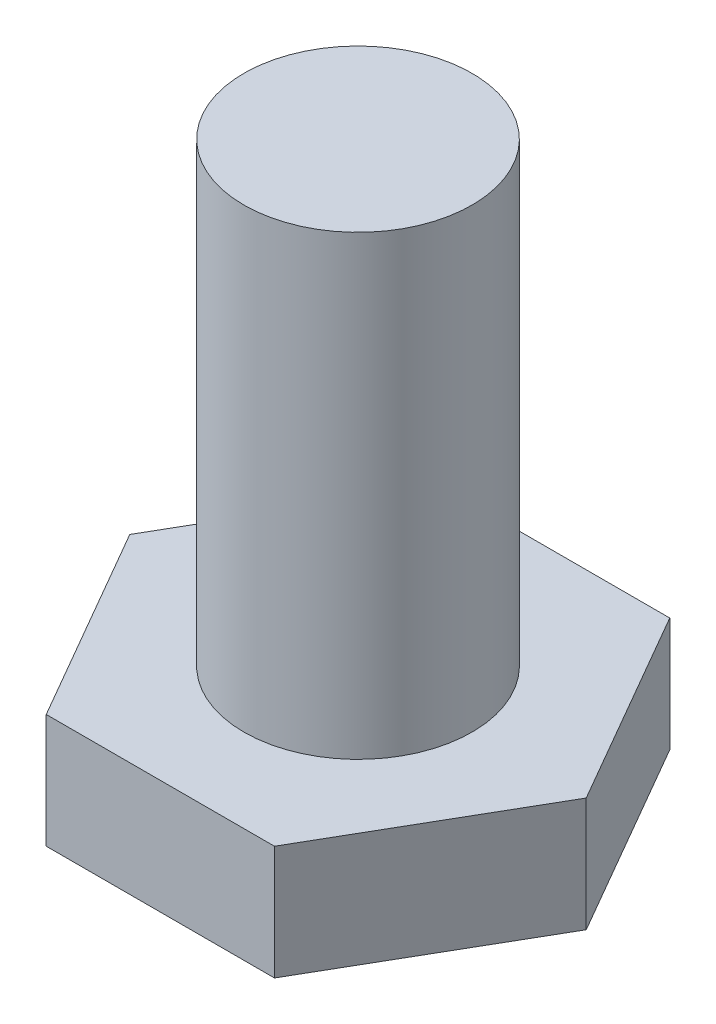
ISO-10303-21;
HEADER;
FILE_DESCRIPTION(('STEP AP214'),'2;1');
FILE_NAME('part.step','',(''),(''),'','','');
FILE_SCHEMA(('AUTOMOTIVE_DESIGN { 1 0 10303 214 1 1 1 1 }'));
ENDSEC;
DATA;
#1=APPLICATION_CONTEXT('core data for automotive mechanical design processes');
#2=APPLICATION_PROTOCOL_DEFINITION('international standard','automotive_design',2000,#1);
#3=PRODUCT_CONTEXT('',#1,'mechanical');
#4=PRODUCT('Part','Part','',(#3));
#5=PRODUCT_RELATED_PRODUCT_CATEGORY('part','',(#4));
#6=PRODUCT_DEFINITION_FORMATION('','',#4);
#7=PRODUCT_DEFINITION_CONTEXT('part definition',#1,'design');
#8=PRODUCT_DEFINITION('design','',#6,#7);
#9=PRODUCT_DEFINITION_SHAPE('','',#8);
#10=(LENGTH_UNIT() NAMED_UNIT(*) SI_UNIT(.MILLI.,.METRE.));
#11=(NAMED_UNIT(*) PLANE_ANGLE_UNIT() SI_UNIT($,.RADIAN.));
#12=(NAMED_UNIT(*) SI_UNIT($,.STERADIAN.) SOLID_ANGLE_UNIT());
#13=UNCERTAINTY_MEASURE_WITH_UNIT(LENGTH_MEASURE(1.E-05),#10,'distance_accuracy_value','');
#14=(GEOMETRIC_REPRESENTATION_CONTEXT(3) GLOBAL_UNCERTAINTY_ASSIGNED_CONTEXT((#13)) GLOBAL_UNIT_ASSIGNED_CONTEXT((#10,
#11,#12)) REPRESENTATION_CONTEXT('',''));
#15=CARTESIAN_POINT('',(0.,0.,0.));
#16=DIRECTION('',(0.,0.,1.));
#17=DIRECTION('',(1.,0.,0.));
#18=AXIS2_PLACEMENT_3D('',#15,#16,#17);
#19=CARTESIAN_POINT('',(-3.,3.,5.19615242270664));
#20=DIRECTION('',(0.,0.,-1.));
#21=DIRECTION('',(-1.,0.,0.));
#22=AXIS2_PLACEMENT_3D('',#19,#20,#21);
#23=PLANE('',#22);
#24=DIRECTION('',(1.,0.,0.));
#25=VECTOR('',#24,1.);
#26=CARTESIAN_POINT('',(-3.,0.,5.19615242270664));
#27=LINE('',#26,#25);
#28=CARTESIAN_POINT('',(-3.,0.,5.19615242270664));
#29=VERTEX_POINT('',#28);
#30=CARTESIAN_POINT('',(3.,0.,5.19615242270664));
#31=VERTEX_POINT('',#30);
#32=EDGE_CURVE('E133',#29,#31,#27,.T.);
#33=ORIENTED_EDGE('',*,*,#32,.T.);
#34=DIRECTION('',(0.,-1.,0.));
#35=VECTOR('',#34,1.);
#36=CARTESIAN_POINT('',(3.,3.,5.19615242270664));
#37=LINE('',#36,#35);
#38=CARTESIAN_POINT('',(3.,3.,5.19615242270664));
#39=VERTEX_POINT('',#38);
#40=EDGE_CURVE('E50',#39,#31,#37,.T.);
#41=ORIENTED_EDGE('',*,*,#40,.F.);
#42=DIRECTION('',(1.,0.,0.));
#43=VECTOR('',#42,1.);
#44=CARTESIAN_POINT('',(-3.,3.,5.19615242270664));
#45=LINE('',#44,#43);
#46=CARTESIAN_POINT('',(-3.,3.,5.19615242270664));
#47=VERTEX_POINT('',#46);
#48=EDGE_CURVE('E144',#47,#39,#45,.T.);
#49=ORIENTED_EDGE('',*,*,#48,.F.);
#50=DIRECTION('',(0.,-1.,0.));
#51=VECTOR('',#50,1.);
#52=CARTESIAN_POINT('',(-3.,3.,5.19615242270664));
#53=LINE('',#52,#51);
#54=EDGE_CURVE('E129',#47,#29,#53,.T.);
#55=ORIENTED_EDGE('',*,*,#54,.T.);
#56=EDGE_LOOP('',(#33,#41,#49,#55));
#57=FACE_BOUND('',#56,.T.);
#58=ADVANCED_FACE('F47',(#57),#23,.F.);
#59=CARTESIAN_POINT('',(3.,3.,5.19615242270664));
#60=DIRECTION('',(-0.866025403784439,0.,-0.499999999999999));
#61=DIRECTION('',(-0.499999999999999,0.,0.866025403784439));
#62=AXIS2_PLACEMENT_3D('',#59,#60,#61);
#63=PLANE('',#62);
#64=DIRECTION('',(0.499999999999999,0.,-0.866025403784439));
#65=VECTOR('',#64,1.);
#66=CARTESIAN_POINT('',(3.,0.,5.19615242270664));
#67=LINE('',#66,#65);
#68=CARTESIAN_POINT('',(6.,0.,0.));
#69=VERTEX_POINT('',#68);
#70=EDGE_CURVE('E136',#31,#69,#67,.T.);
#71=ORIENTED_EDGE('',*,*,#70,.T.);
#72=DIRECTION('',(0.,-1.,0.));
#73=VECTOR('',#72,1.);
#74=CARTESIAN_POINT('',(6.,3.,0.));
#75=LINE('',#74,#73);
#76=CARTESIAN_POINT('',(6.,3.,0.));
#77=VERTEX_POINT('',#76);
#78=EDGE_CURVE('E147',#77,#69,#75,.T.);
#79=ORIENTED_EDGE('',*,*,#78,.F.);
#80=DIRECTION('',(0.499999999999999,0.,-0.866025403784439));
#81=VECTOR('',#80,1.);
#82=CARTESIAN_POINT('',(3.,3.,5.19615242270664));
#83=LINE('',#82,#81);
#84=EDGE_CURVE('E102',#39,#77,#83,.T.);
#85=ORIENTED_EDGE('',*,*,#84,.F.);
#86=ORIENTED_EDGE('',*,*,#40,.T.);
#87=EDGE_LOOP('',(#71,#79,#85,#86));
#88=FACE_BOUND('',#87,.T.);
#89=ADVANCED_FACE('F152',(#88),#63,.F.);
#90=CARTESIAN_POINT('',(6.,3.,0.));
#91=DIRECTION('',(-0.866025403784439,0.,0.5));
#92=DIRECTION('',(0.5,0.,0.866025403784439));
#93=AXIS2_PLACEMENT_3D('',#90,#91,#92);
#94=PLANE('',#93);
#95=DIRECTION('',(-0.5,0.,-0.866025403784439));
#96=VECTOR('',#95,1.);
#97=CARTESIAN_POINT('',(6.,0.,0.));
#98=LINE('',#97,#96);
#99=CARTESIAN_POINT('',(3.,0.,-5.19615242270663));
#100=VERTEX_POINT('',#99);
#101=EDGE_CURVE('E139',#69,#100,#98,.T.);
#102=ORIENTED_EDGE('',*,*,#101,.T.);
#103=DIRECTION('',(0.,-1.,0.));
#104=VECTOR('',#103,1.);
#105=CARTESIAN_POINT('',(3.,3.,-5.19615242270663));
#106=LINE('',#105,#104);
#107=CARTESIAN_POINT('',(3.,3.,-5.19615242270663));
#108=VERTEX_POINT('',#107);
#109=EDGE_CURVE('E124',#108,#100,#106,.T.);
#110=ORIENTED_EDGE('',*,*,#109,.F.);
#111=DIRECTION('',(-0.5,0.,-0.866025403784439));
#112=VECTOR('',#111,1.);
#113=CARTESIAN_POINT('',(6.,3.,0.));
#114=LINE('',#113,#112);
#115=EDGE_CURVE('E115',#77,#108,#114,.T.);
#116=ORIENTED_EDGE('',*,*,#115,.F.);
#117=ORIENTED_EDGE('',*,*,#78,.T.);
#118=EDGE_LOOP('',(#102,#110,#116,#117));
#119=FACE_BOUND('',#118,.T.);
#120=ADVANCED_FACE('F158',(#119),#94,.F.);
#121=CARTESIAN_POINT('',(3.,3.,-5.19615242270663));
#122=DIRECTION('',(0.,0.,1.));
#123=DIRECTION('',(1.,0.,0.));
#124=AXIS2_PLACEMENT_3D('',#121,#122,#123);
#125=PLANE('',#124);
#126=DIRECTION('',(-1.,0.,0.));
#127=VECTOR('',#126,1.);
#128=CARTESIAN_POINT('',(3.,0.,-5.19615242270663));
#129=LINE('',#128,#127);
#130=CARTESIAN_POINT('',(-3.,0.,-5.19615242270663));
#131=VERTEX_POINT('',#130);
#132=EDGE_CURVE('E123',#100,#131,#129,.T.);
#133=ORIENTED_EDGE('',*,*,#132,.T.);
#134=DIRECTION('',(0.,-1.,0.));
#135=VECTOR('',#134,1.);
#136=CARTESIAN_POINT('',(-3.,3.,-5.19615242270663));
#137=LINE('',#136,#135);
#138=CARTESIAN_POINT('',(-3.,3.,-5.19615242270663));
#139=VERTEX_POINT('',#138);
#140=EDGE_CURVE('E120',#139,#131,#137,.T.);
#141=ORIENTED_EDGE('',*,*,#140,.F.);
#142=DIRECTION('',(-1.,0.,0.));
#143=VECTOR('',#142,1.);
#144=CARTESIAN_POINT('',(3.,3.,-5.19615242270663));
#145=LINE('',#144,#143);
#146=EDGE_CURVE('E109',#108,#139,#145,.T.);
#147=ORIENTED_EDGE('',*,*,#146,.F.);
#148=ORIENTED_EDGE('',*,*,#109,.T.);
#149=EDGE_LOOP('',(#133,#141,#147,#148));
#150=FACE_BOUND('',#149,.T.);
#151=ADVANCED_FACE('F121',(#150),#125,.F.);
#152=CARTESIAN_POINT('',(-3.,3.,-5.19615242270663));
#153=DIRECTION('',(0.866025403784439,0.,0.5));
#154=DIRECTION('',(0.5,0.,-0.866025403784439));
#155=AXIS2_PLACEMENT_3D('',#152,#153,#154);
#156=PLANE('',#155);
#157=DIRECTION('',(-0.5,0.,0.866025403784439));
#158=VECTOR('',#157,1.);
#159=CARTESIAN_POINT('',(-3.,0.,-5.19615242270663));
#160=LINE('',#159,#158);
#161=CARTESIAN_POINT('',(-6.,0.,0.));
#162=VERTEX_POINT('',#161);
#163=EDGE_CURVE('E87',#131,#162,#160,.T.);
#164=ORIENTED_EDGE('',*,*,#163,.T.);
#165=DIRECTION('',(0.,-1.,0.));
#166=VECTOR('',#165,1.);
#167=CARTESIAN_POINT('',(-6.,3.,0.));
#168=LINE('',#167,#166);
#169=CARTESIAN_POINT('',(-6.,3.,0.));
#170=VERTEX_POINT('',#169);
#171=EDGE_CURVE('E125',#170,#162,#168,.T.);
#172=ORIENTED_EDGE('',*,*,#171,.F.);
#173=DIRECTION('',(-0.5,0.,0.866025403784439));
#174=VECTOR('',#173,1.);
#175=CARTESIAN_POINT('',(-3.,3.,-5.19615242270663));
#176=LINE('',#175,#174);
#177=EDGE_CURVE('E113',#139,#170,#176,.T.);
#178=ORIENTED_EDGE('',*,*,#177,.F.);
#179=ORIENTED_EDGE('',*,*,#140,.T.);
#180=EDGE_LOOP('',(#164,#172,#178,#179));
#181=FACE_BOUND('',#180,.T.);
#182=ADVANCED_FACE('F127',(#181),#156,.F.);
#183=CARTESIAN_POINT('',(-6.,3.,0.));
#184=DIRECTION('',(0.866025403784439,0.,-0.5));
#185=DIRECTION('',(-0.5,0.,-0.866025403784439));
#186=AXIS2_PLACEMENT_3D('',#183,#184,#185);
#187=PLANE('',#186);
#188=DIRECTION('',(0.5,0.,0.866025403784439));
#189=VECTOR('',#188,1.);
#190=CARTESIAN_POINT('',(-6.,0.,0.));
#191=LINE('',#190,#189);
#192=EDGE_CURVE('E93',#162,#29,#191,.T.);
#193=ORIENTED_EDGE('',*,*,#192,.T.);
#194=ORIENTED_EDGE('',*,*,#54,.F.);
#195=DIRECTION('',(0.5,0.,0.866025403784439));
#196=VECTOR('',#195,1.);
#197=CARTESIAN_POINT('',(-6.,3.,0.));
#198=LINE('',#197,#196);
#199=EDGE_CURVE('E64',#170,#47,#198,.T.);
#200=ORIENTED_EDGE('',*,*,#199,.F.);
#201=ORIENTED_EDGE('',*,*,#171,.T.);
#202=EDGE_LOOP('',(#193,#194,#200,#201));
#203=FACE_BOUND('',#202,.T.);
#204=ADVANCED_FACE('F174',(#203),#187,.F.);
#205=CARTESIAN_POINT('',(0.,3.,0.));
#206=DIRECTION('',(0.,1.,0.));
#207=DIRECTION('',(0.,0.,1.));
#208=AXIS2_PLACEMENT_3D('',#205,#206,#207);
#209=PLANE('',#208);
#210=CARTESIAN_POINT('',(0.,3.,0.));
#211=DIRECTION('',(0.,1.,0.));
#212=DIRECTION('',(0.,0.,1.));
#213=AXIS2_PLACEMENT_3D('',#210,#211,#212);
#214=CIRCLE('',#213,3.);
#215=CARTESIAN_POINT('',(0.,3.,3.));
#216=VERTEX_POINT('',#215);
#217=EDGE_CURVE('E11',#216,#216,#214,.T.);
#218=ORIENTED_EDGE('',*,*,#217,.F.);
#219=EDGE_LOOP('',(#218));
#220=FACE_BOUND('',#219,.T.);
#221=ORIENTED_EDGE('',*,*,#48,.T.);
#222=ORIENTED_EDGE('',*,*,#84,.T.);
#223=ORIENTED_EDGE('',*,*,#115,.T.);
#224=ORIENTED_EDGE('',*,*,#146,.T.);
#225=ORIENTED_EDGE('',*,*,#177,.T.);
#226=ORIENTED_EDGE('',*,*,#199,.T.);
#227=EDGE_LOOP('',(#221,#222,#223,#224,#225,#226));
#228=FACE_BOUND('',#227,.T.);
#229=ADVANCED_FACE('F111',(#220,#228),#209,.T.);
#230=CARTESIAN_POINT('',(0.,0.,0.));
#231=DIRECTION('',(0.,1.,0.));
#232=DIRECTION('',(0.,0.,1.));
#233=AXIS2_PLACEMENT_3D('',#230,#231,#232);
#234=PLANE('',#233);
#235=ORIENTED_EDGE('',*,*,#32,.F.);
#236=ORIENTED_EDGE('',*,*,#192,.F.);
#237=ORIENTED_EDGE('',*,*,#163,.F.);
#238=ORIENTED_EDGE('',*,*,#132,.F.);
#239=ORIENTED_EDGE('',*,*,#101,.F.);
#240=ORIENTED_EDGE('',*,*,#70,.F.);
#241=EDGE_LOOP('',(#235,#236,#237,#238,#239,#240));
#242=FACE_BOUND('',#241,.T.);
#243=ADVANCED_FACE('F157',(#242),#234,.F.);
#244=CARTESIAN_POINT('',(0.,15.,0.));
#245=DIRECTION('',(0.,-1.,0.));
#246=DIRECTION('',(0.,0.,-1.));
#247=AXIS2_PLACEMENT_3D('',#244,#245,#246);
#248=CYLINDRICAL_SURFACE('',#247,3.);
#249=CARTESIAN_POINT('',(0.,15.,0.));
#250=DIRECTION('',(0.,1.,0.));
#251=DIRECTION('',(0.,0.,1.));
#252=AXIS2_PLACEMENT_3D('',#249,#250,#251);
#253=CIRCLE('',#252,3.);
#254=CARTESIAN_POINT('',(0.,15.,3.));
#255=VERTEX_POINT('',#254);
#256=EDGE_CURVE('E137',#255,#255,#253,.T.);
#257=ORIENTED_EDGE('',*,*,#256,.F.);
#258=EDGE_LOOP('',(#257));
#259=FACE_BOUND('',#258,.T.);
#260=ORIENTED_EDGE('',*,*,#217,.T.);
#261=EDGE_LOOP('',(#260));
#262=FACE_BOUND('',#261,.T.);
#263=ADVANCED_FACE('F167',(#259,#262),#248,.T.);
#264=CARTESIAN_POINT('',(0.,15.,0.));
#265=DIRECTION('',(0.,1.,0.));
#266=DIRECTION('',(0.,0.,1.));
#267=AXIS2_PLACEMENT_3D('',#264,#265,#266);
#268=PLANE('',#267);
#269=ORIENTED_EDGE('',*,*,#256,.T.);
#270=EDGE_LOOP('',(#269));
#271=FACE_BOUND('',#270,.T.);
#272=ADVANCED_FACE('F165',(#271),#268,.T.);
#273=CLOSED_SHELL('',(#58,#89,#120,#151,#182,#204,#229,#243,#263,#272));
#274=MANIFOLD_SOLID_BREP('B2',#273);
#275=ADVANCED_BREP_SHAPE_REPRESENTATION('',(#18,#274),#14);
#276=SHAPE_DEFINITION_REPRESENTATION(#9,#275);
ENDSEC;
END-ISO-10303-21;
